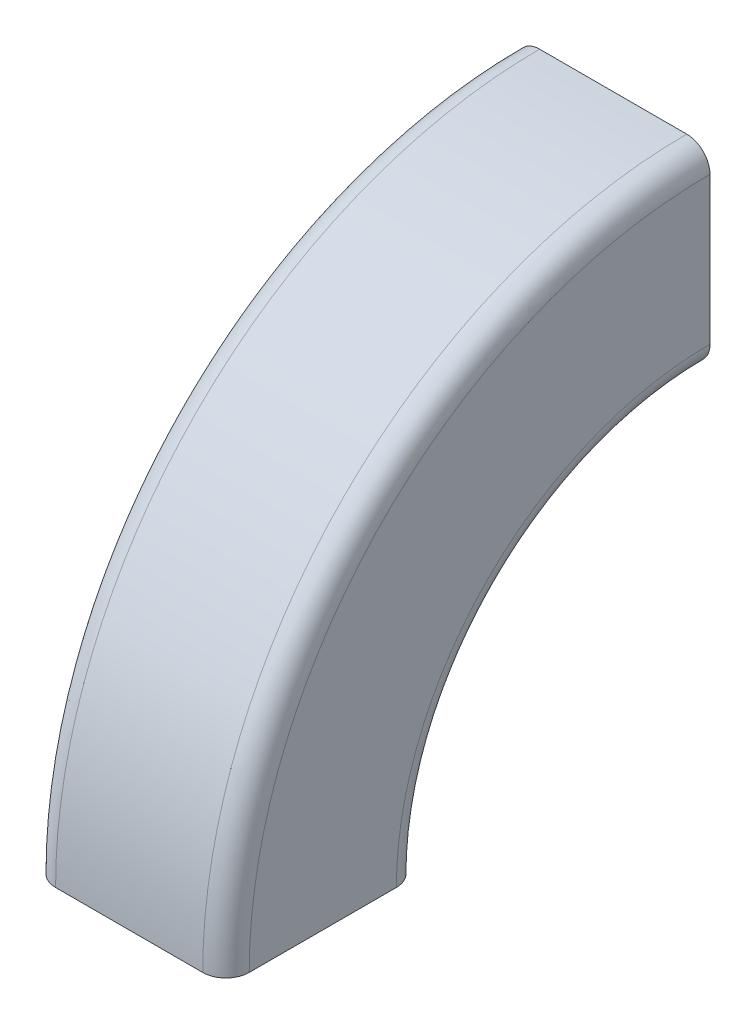
ISO-10303-21;
HEADER;
FILE_DESCRIPTION(('STEP AP214'),'2;1');
FILE_NAME('part.step','',(''),(''),'','','');
FILE_SCHEMA(('AUTOMOTIVE_DESIGN { 1 0 10303 214 1 1 1 1 }'));
ENDSEC;
DATA;
#1=APPLICATION_CONTEXT('core data for automotive mechanical design processes');
#2=APPLICATION_PROTOCOL_DEFINITION('international standard','automotive_design',2000,#1);
#3=PRODUCT_CONTEXT('',#1,'mechanical');
#4=PRODUCT('Part','Part','',(#3));
#5=PRODUCT_RELATED_PRODUCT_CATEGORY('part','',(#4));
#6=PRODUCT_DEFINITION_FORMATION('','',#4);
#7=PRODUCT_DEFINITION_CONTEXT('part definition',#1,'design');
#8=PRODUCT_DEFINITION('design','',#6,#7);
#9=PRODUCT_DEFINITION_SHAPE('','',#8);
#10=(LENGTH_UNIT() NAMED_UNIT(*) SI_UNIT(.MILLI.,.METRE.));
#11=(NAMED_UNIT(*) PLANE_ANGLE_UNIT() SI_UNIT($,.RADIAN.));
#12=(NAMED_UNIT(*) SI_UNIT($,.STERADIAN.) SOLID_ANGLE_UNIT());
#13=UNCERTAINTY_MEASURE_WITH_UNIT(LENGTH_MEASURE(1.E-05),#10,'distance_accuracy_value','');
#14=(GEOMETRIC_REPRESENTATION_CONTEXT(3) GLOBAL_UNCERTAINTY_ASSIGNED_CONTEXT((#13)) GLOBAL_UNIT_ASSIGNED_CONTEXT((#10,
#11,#12)) REPRESENTATION_CONTEXT('',''));
#15=CARTESIAN_POINT('',(0.,0.,0.));
#16=DIRECTION('',(0.,0.,1.));
#17=DIRECTION('',(1.,0.,0.));
#18=AXIS2_PLACEMENT_3D('',#15,#16,#17);
#19=CARTESIAN_POINT('',(0.,0.,0.));
#20=DIRECTION('',(0.,0.,1.));
#21=DIRECTION('',(1.,0.,0.));
#22=AXIS2_PLACEMENT_3D('',#19,#20,#21);
#23=PLANE('',#22);
#24=CARTESIAN_POINT('',(-9.5,-9.5,0.));
#25=DIRECTION('',(0.,0.,-1.));
#26=DIRECTION('',(1.,0.,0.));
#27=AXIS2_PLACEMENT_3D('',#24,#25,#26);
#28=CIRCLE('',#27,3.);
#29=CARTESIAN_POINT('',(-9.5,-12.5,0.));
#30=VERTEX_POINT('',#29);
#31=CARTESIAN_POINT('',(-12.5,-9.5,0.));
#32=VERTEX_POINT('',#31);
#33=EDGE_CURVE('E27',#30,#32,#28,.T.);
#34=ORIENTED_EDGE('',*,*,#33,.T.);
#35=DIRECTION('',(0.,1.,0.));
#36=VECTOR('',#35,1.);
#37=CARTESIAN_POINT('',(-12.5,-9.5,0.));
#38=LINE('',#37,#36);
#39=CARTESIAN_POINT('',(-12.5,9.5,0.));
#40=VERTEX_POINT('',#39);
#41=EDGE_CURVE('E268',#32,#40,#38,.T.);
#42=ORIENTED_EDGE('',*,*,#41,.T.);
#43=CARTESIAN_POINT('',(-9.5,9.5,0.));
#44=DIRECTION('',(0.,0.,-1.));
#45=DIRECTION('',(0.,-1.,0.));
#46=AXIS2_PLACEMENT_3D('',#43,#44,#45);
#47=CIRCLE('',#46,3.);
#48=CARTESIAN_POINT('',(-9.5,12.5,0.));
#49=VERTEX_POINT('',#48);
#50=EDGE_CURVE('E185',#40,#49,#47,.T.);
#51=ORIENTED_EDGE('',*,*,#50,.T.);
#52=DIRECTION('',(1.,0.,0.));
#53=VECTOR('',#52,1.);
#54=CARTESIAN_POINT('',(-9.5,12.5,0.));
#55=LINE('',#54,#53);
#56=CARTESIAN_POINT('',(9.5,12.5,0.));
#57=VERTEX_POINT('',#56);
#58=EDGE_CURVE('E170',#49,#57,#55,.T.);
#59=ORIENTED_EDGE('',*,*,#58,.T.);
#60=CARTESIAN_POINT('',(9.5,9.5,0.));
#61=DIRECTION('',(0.,0.,-1.));
#62=DIRECTION('',(-1.,0.,0.));
#63=AXIS2_PLACEMENT_3D('',#60,#61,#62);
#64=CIRCLE('',#63,3.);
#65=CARTESIAN_POINT('',(12.5,9.5,0.));
#66=VERTEX_POINT('',#65);
#67=EDGE_CURVE('E242',#57,#66,#64,.T.);
#68=ORIENTED_EDGE('',*,*,#67,.T.);
#69=DIRECTION('',(0.,-1.,0.));
#70=VECTOR('',#69,1.);
#71=CARTESIAN_POINT('',(12.5,9.5,0.));
#72=LINE('',#71,#70);
#73=CARTESIAN_POINT('',(12.5,-9.5,0.));
#74=VERTEX_POINT('',#73);
#75=EDGE_CURVE('E251',#66,#74,#72,.T.);
#76=ORIENTED_EDGE('',*,*,#75,.T.);
#77=CARTESIAN_POINT('',(9.5,-9.5,0.));
#78=DIRECTION('',(0.,0.,-1.));
#79=DIRECTION('',(0.,1.,0.));
#80=AXIS2_PLACEMENT_3D('',#77,#78,#79);
#81=CIRCLE('',#80,3.);
#82=CARTESIAN_POINT('',(9.5,-12.5,0.));
#83=VERTEX_POINT('',#82);
#84=EDGE_CURVE('E294',#74,#83,#81,.T.);
#85=ORIENTED_EDGE('',*,*,#84,.T.);
#86=DIRECTION('',(-1.,0.,0.));
#87=VECTOR('',#86,1.);
#88=CARTESIAN_POINT('',(9.5,-12.5,0.));
#89=LINE('',#88,#87);
#90=EDGE_CURVE('E282',#83,#30,#89,.T.);
#91=ORIENTED_EDGE('',*,*,#90,.T.);
#92=EDGE_LOOP('',(#34,#42,#51,#59,#68,#76,#85,#91));
#93=FACE_BOUND('',#92,.T.);
#94=DIRECTION('',(-1.,0.,0.));
#95=VECTOR('',#94,1.);
#96=CARTESIAN_POINT('',(0.,10.5,0.));
#97=LINE('',#96,#95);
#98=CARTESIAN_POINT('',(9.5,10.5,0.));
#99=VERTEX_POINT('',#98);
#100=CARTESIAN_POINT('',(-9.5,10.5,0.));
#101=VERTEX_POINT('',#100);
#102=EDGE_CURVE('E279',#99,#101,#97,.T.);
#103=ORIENTED_EDGE('',*,*,#102,.T.);
#104=CARTESIAN_POINT('',(-9.5,9.5,0.));
#105=DIRECTION('',(0.,0.,1.));
#106=DIRECTION('',(0.,1.,0.));
#107=AXIS2_PLACEMENT_3D('',#104,#105,#106);
#108=CIRCLE('',#107,1.);
#109=CARTESIAN_POINT('',(-10.5,9.5,0.));
#110=VERTEX_POINT('',#109);
#111=EDGE_CURVE('E194',#101,#110,#108,.T.);
#112=ORIENTED_EDGE('',*,*,#111,.T.);
#113=DIRECTION('',(0.,-1.,0.));
#114=VECTOR('',#113,1.);
#115=CARTESIAN_POINT('',(-10.5,4.75,0.));
#116=LINE('',#115,#114);
#117=CARTESIAN_POINT('',(-10.5,-9.5,0.));
#118=VERTEX_POINT('',#117);
#119=EDGE_CURVE('E202',#110,#118,#116,.T.);
#120=ORIENTED_EDGE('',*,*,#119,.T.);
#121=CARTESIAN_POINT('',(-9.5,-9.5,0.));
#122=DIRECTION('',(0.,0.,1.));
#123=DIRECTION('',(0.,1.,0.));
#124=AXIS2_PLACEMENT_3D('',#121,#122,#123);
#125=CIRCLE('',#124,1.);
#126=CARTESIAN_POINT('',(-9.5,-10.5,0.));
#127=VERTEX_POINT('',#126);
#128=EDGE_CURVE('E219',#118,#127,#125,.T.);
#129=ORIENTED_EDGE('',*,*,#128,.T.);
#130=DIRECTION('',(1.,0.,0.));
#131=VECTOR('',#130,1.);
#132=CARTESIAN_POINT('',(0.,-10.5,0.));
#133=LINE('',#132,#131);
#134=CARTESIAN_POINT('',(9.5,-10.5,0.));
#135=VERTEX_POINT('',#134);
#136=EDGE_CURVE('E201',#127,#135,#133,.T.);
#137=ORIENTED_EDGE('',*,*,#136,.T.);
#138=CARTESIAN_POINT('',(9.5,-9.5,0.));
#139=DIRECTION('',(0.,0.,1.));
#140=DIRECTION('',(0.,1.,0.));
#141=AXIS2_PLACEMENT_3D('',#138,#139,#140);
#142=CIRCLE('',#141,1.);
#143=CARTESIAN_POINT('',(10.5,-9.5,0.));
#144=VERTEX_POINT('',#143);
#145=EDGE_CURVE('E211',#135,#144,#142,.T.);
#146=ORIENTED_EDGE('',*,*,#145,.T.);
#147=DIRECTION('',(0.,1.,0.));
#148=VECTOR('',#147,1.);
#149=CARTESIAN_POINT('',(10.5,-4.75,0.));
#150=LINE('',#149,#148);
#151=CARTESIAN_POINT('',(10.5,9.5,0.));
#152=VERTEX_POINT('',#151);
#153=EDGE_CURVE('E229',#144,#152,#150,.T.);
#154=ORIENTED_EDGE('',*,*,#153,.T.);
#155=CARTESIAN_POINT('',(9.5,9.5,0.));
#156=DIRECTION('',(0.,0.,1.));
#157=DIRECTION('',(0.,1.,0.));
#158=AXIS2_PLACEMENT_3D('',#155,#156,#157);
#159=CIRCLE('',#158,1.);
#160=EDGE_CURVE('E220',#152,#99,#159,.T.);
#161=ORIENTED_EDGE('',*,*,#160,.T.);
#162=EDGE_LOOP('',(#103,#112,#120,#129,#137,#146,#154,#161));
#163=FACE_BOUND('',#162,.T.);
#164=ADVANCED_FACE('F16',(#93,#163),#23,.F.);
#165=CARTESIAN_POINT('',(0.,-50.,50.));
#166=DIRECTION('',(0.,-1.,0.));
#167=DIRECTION('',(-1.,0.,0.));
#168=AXIS2_PLACEMENT_3D('',#165,#166,#167);
#169=PLANE('',#168);
#170=CARTESIAN_POINT('',(-9.5,-50.,40.5));
#171=DIRECTION('',(0.,-1.,0.));
#172=DIRECTION('',(1.,0.,0.));
#173=AXIS2_PLACEMENT_3D('',#170,#171,#172);
#174=CIRCLE('',#173,3.);
#175=CARTESIAN_POINT('',(-12.5,-50.,40.5));
#176=VERTEX_POINT('',#175);
#177=CARTESIAN_POINT('',(-9.5,-50.,37.5));
#178=VERTEX_POINT('',#177);
#179=EDGE_CURVE('E11',#176,#178,#174,.T.);
#180=ORIENTED_EDGE('',*,*,#179,.T.);
#181=DIRECTION('',(1.,0.,0.));
#182=VECTOR('',#181,1.);
#183=CARTESIAN_POINT('',(9.5,-50.,37.5));
#184=LINE('',#183,#182);
#185=CARTESIAN_POINT('',(9.5,-50.,37.5));
#186=VERTEX_POINT('',#185);
#187=EDGE_CURVE('E237',#178,#186,#184,.T.);
#188=ORIENTED_EDGE('',*,*,#187,.T.);
#189=CARTESIAN_POINT('',(9.5,-50.,40.5));
#190=DIRECTION('',(0.,-1.,0.));
#191=DIRECTION('',(0.,0.,1.));
#192=AXIS2_PLACEMENT_3D('',#189,#190,#191);
#193=CIRCLE('',#192,3.);
#194=CARTESIAN_POINT('',(12.5,-50.,40.5));
#195=VERTEX_POINT('',#194);
#196=EDGE_CURVE('E291',#186,#195,#193,.T.);
#197=ORIENTED_EDGE('',*,*,#196,.T.);
#198=DIRECTION('',(0.,0.,1.));
#199=VECTOR('',#198,1.);
#200=CARTESIAN_POINT('',(12.5,-50.,59.5));
#201=LINE('',#200,#199);
#202=CARTESIAN_POINT('',(12.5,-50.,59.5));
#203=VERTEX_POINT('',#202);
#204=EDGE_CURVE('E248',#195,#203,#201,.T.);
#205=ORIENTED_EDGE('',*,*,#204,.T.);
#206=CARTESIAN_POINT('',(9.5,-50.,59.5));
#207=DIRECTION('',(0.,-1.,0.));
#208=DIRECTION('',(-1.,0.,0.));
#209=AXIS2_PLACEMENT_3D('',#206,#207,#208);
#210=CIRCLE('',#209,3.);
#211=CARTESIAN_POINT('',(9.5,-50.,62.5));
#212=VERTEX_POINT('',#211);
#213=EDGE_CURVE('E164',#203,#212,#210,.T.);
#214=ORIENTED_EDGE('',*,*,#213,.T.);
#215=DIRECTION('',(-1.,0.,0.));
#216=VECTOR('',#215,1.);
#217=CARTESIAN_POINT('',(-9.5,-50.,62.5));
#218=LINE('',#217,#216);
#219=CARTESIAN_POINT('',(-9.5,-50.,62.5));
#220=VERTEX_POINT('',#219);
#221=EDGE_CURVE('E155',#212,#220,#218,.T.);
#222=ORIENTED_EDGE('',*,*,#221,.T.);
#223=CARTESIAN_POINT('',(-9.5,-50.,59.5));
#224=DIRECTION('',(0.,-1.,0.));
#225=DIRECTION('',(0.,0.,-1.));
#226=AXIS2_PLACEMENT_3D('',#223,#224,#225);
#227=CIRCLE('',#226,3.);
#228=CARTESIAN_POINT('',(-12.5,-50.,59.5));
#229=VERTEX_POINT('',#228);
#230=EDGE_CURVE('E160',#220,#229,#227,.T.);
#231=ORIENTED_EDGE('',*,*,#230,.T.);
#232=DIRECTION('',(0.,0.,-1.));
#233=VECTOR('',#232,1.);
#234=CARTESIAN_POINT('',(-12.5,-50.,40.5));
#235=LINE('',#234,#233);
#236=EDGE_CURVE('E20',#229,#176,#235,.T.);
#237=ORIENTED_EDGE('',*,*,#236,.T.);
#238=EDGE_LOOP('',(#180,#188,#197,#205,#214,#222,#231,#237));
#239=FACE_BOUND('',#238,.T.);
#240=DIRECTION('',(1.,0.,0.));
#241=VECTOR('',#240,1.);
#242=CARTESIAN_POINT('',(0.,-50.,60.5));
#243=LINE('',#242,#241);
#244=CARTESIAN_POINT('',(-9.5,-50.,60.5));
#245=VERTEX_POINT('',#244);
#246=CARTESIAN_POINT('',(9.5,-50.,60.5));
#247=VERTEX_POINT('',#246);
#248=EDGE_CURVE('E278',#245,#247,#243,.T.);
#249=ORIENTED_EDGE('',*,*,#248,.T.);
#250=CARTESIAN_POINT('',(9.5,-50.,59.5));
#251=DIRECTION('',(0.,1.,0.));
#252=DIRECTION('',(0.,0.,1.));
#253=AXIS2_PLACEMENT_3D('',#250,#251,#252);
#254=CIRCLE('',#253,1.);
#255=CARTESIAN_POINT('',(10.5,-50.,59.5));
#256=VERTEX_POINT('',#255);
#257=EDGE_CURVE('E225',#247,#256,#254,.T.);
#258=ORIENTED_EDGE('',*,*,#257,.T.);
#259=DIRECTION('',(0.,0.,-1.));
#260=VECTOR('',#259,1.);
#261=CARTESIAN_POINT('',(10.5,-50.,25.));
#262=LINE('',#261,#260);
#263=CARTESIAN_POINT('',(10.5,-50.,40.5));
#264=VERTEX_POINT('',#263);
#265=EDGE_CURVE('E215',#256,#264,#262,.T.);
#266=ORIENTED_EDGE('',*,*,#265,.T.);
#267=CARTESIAN_POINT('',(9.5,-50.,40.5));
#268=DIRECTION('',(0.,1.,0.));
#269=DIRECTION('',(0.,0.,1.));
#270=AXIS2_PLACEMENT_3D('',#267,#268,#269);
#271=CIRCLE('',#270,1.);
#272=CARTESIAN_POINT('',(9.5,-50.,39.5));
#273=VERTEX_POINT('',#272);
#274=EDGE_CURVE('E247',#264,#273,#271,.T.);
#275=ORIENTED_EDGE('',*,*,#274,.T.);
#276=DIRECTION('',(-1.,0.,0.));
#277=VECTOR('',#276,1.);
#278=CARTESIAN_POINT('',(0.,-50.,39.5));
#279=LINE('',#278,#277);
#280=CARTESIAN_POINT('',(-9.5,-50.,39.5));
#281=VERTEX_POINT('',#280);
#282=EDGE_CURVE('E200',#273,#281,#279,.T.);
#283=ORIENTED_EDGE('',*,*,#282,.T.);
#284=CARTESIAN_POINT('',(-9.5,-50.,40.5));
#285=DIRECTION('',(0.,1.,0.));
#286=DIRECTION('',(0.,0.,1.));
#287=AXIS2_PLACEMENT_3D('',#284,#285,#286);
#288=CIRCLE('',#287,1.);
#289=CARTESIAN_POINT('',(-10.5,-50.,40.5));
#290=VERTEX_POINT('',#289);
#291=EDGE_CURVE('E205',#281,#290,#288,.T.);
#292=ORIENTED_EDGE('',*,*,#291,.T.);
#293=DIRECTION('',(0.,0.,1.));
#294=VECTOR('',#293,1.);
#295=CARTESIAN_POINT('',(-10.5,-50.,25.));
#296=LINE('',#295,#294);
#297=CARTESIAN_POINT('',(-10.5,-50.,59.5));
#298=VERTEX_POINT('',#297);
#299=EDGE_CURVE('E259',#290,#298,#296,.T.);
#300=ORIENTED_EDGE('',*,*,#299,.T.);
#301=CARTESIAN_POINT('',(-9.5,-50.,59.5));
#302=DIRECTION('',(0.,1.,0.));
#303=DIRECTION('',(0.,0.,1.));
#304=AXIS2_PLACEMENT_3D('',#301,#302,#303);
#305=CIRCLE('',#304,1.);
#306=EDGE_CURVE('E273',#298,#245,#305,.T.);
#307=ORIENTED_EDGE('',*,*,#306,.T.);
#308=EDGE_LOOP('',(#249,#258,#266,#275,#283,#292,#300,#307));
#309=FACE_BOUND('',#308,.T.);
#310=ADVANCED_FACE('F157',(#239,#309),#169,.T.);
#311=CARTESIAN_POINT('',(-9.5,-50.,0.));
#312=DIRECTION('',(1.,0.,0.));
#313=DIRECTION('',(0.,0.,-1.));
#314=AXIS2_PLACEMENT_3D('',#311,#312,#313);
#315=TOROIDAL_SURFACE('',#314,40.5,3.);
#316=ORIENTED_EDGE('',*,*,#33,.F.);
#317=CARTESIAN_POINT('',(-9.5,-50.,0.));
#318=DIRECTION('',(1.,0.,0.));
#319=DIRECTION('',(0.,1.,0.));
#320=AXIS2_PLACEMENT_3D('',#317,#318,#319);
#321=CIRCLE('',#320,37.5);
#322=EDGE_CURVE('E234',#30,#178,#321,.T.);
#323=ORIENTED_EDGE('',*,*,#322,.T.);
#324=ORIENTED_EDGE('',*,*,#179,.F.);
#325=CARTESIAN_POINT('',(-12.5,-50.,0.));
#326=DIRECTION('',(1.,0.,0.));
#327=DIRECTION('',(0.,1.,0.));
#328=AXIS2_PLACEMENT_3D('',#325,#326,#327);
#329=CIRCLE('',#328,40.5);
#330=EDGE_CURVE('E272',#32,#176,#329,.T.);
#331=ORIENTED_EDGE('',*,*,#330,.F.);
#332=EDGE_LOOP('',(#316,#323,#324,#331));
#333=FACE_BOUND('',#332,.T.);
#334=ADVANCED_FACE('F307',(#333),#315,.T.);
#335=CARTESIAN_POINT('',(0.,-50.,0.));
#336=DIRECTION('',(1.,0.,0.));
#337=DIRECTION('',(0.,1.,0.));
#338=AXIS2_PLACEMENT_3D('',#335,#336,#337);
#339=CYLINDRICAL_SURFACE('',#338,37.5);
#340=ORIENTED_EDGE('',*,*,#90,.F.);
#341=CARTESIAN_POINT('',(9.5,-50.,0.));
#342=DIRECTION('',(1.,0.,0.));
#343=DIRECTION('',(0.,1.,0.));
#344=AXIS2_PLACEMENT_3D('',#341,#342,#343);
#345=CIRCLE('',#344,37.5);
#346=EDGE_CURVE('E293',#83,#186,#345,.T.);
#347=ORIENTED_EDGE('',*,*,#346,.T.);
#348=ORIENTED_EDGE('',*,*,#187,.F.);
#349=ORIENTED_EDGE('',*,*,#322,.F.);
#350=EDGE_LOOP('',(#340,#347,#348,#349));
#351=FACE_BOUND('',#350,.T.);
#352=ADVANCED_FACE('F18',(#351),#339,.F.);
#353=CARTESIAN_POINT('',(9.5,-50.,0.));
#354=DIRECTION('',(1.,0.,0.));
#355=DIRECTION('',(0.,0.,-1.));
#356=AXIS2_PLACEMENT_3D('',#353,#354,#355);
#357=TOROIDAL_SURFACE('',#356,40.5,3.);
#358=ORIENTED_EDGE('',*,*,#84,.F.);
#359=CARTESIAN_POINT('',(12.5,-50.,0.));
#360=DIRECTION('',(1.,0.,0.));
#361=DIRECTION('',(0.,1.,0.));
#362=AXIS2_PLACEMENT_3D('',#359,#360,#361);
#363=CIRCLE('',#362,40.5);
#364=EDGE_CURVE('E250',#74,#195,#363,.T.);
#365=ORIENTED_EDGE('',*,*,#364,.T.);
#366=ORIENTED_EDGE('',*,*,#196,.F.);
#367=ORIENTED_EDGE('',*,*,#346,.F.);
#368=EDGE_LOOP('',(#358,#365,#366,#367));
#369=FACE_BOUND('',#368,.T.);
#370=ADVANCED_FACE('F536',(#369),#357,.T.);
#371=CARTESIAN_POINT('',(12.5,-9.5,0.));
#372=DIRECTION('',(1.,0.,0.));
#373=DIRECTION('',(0.,0.,-1.));
#374=AXIS2_PLACEMENT_3D('',#371,#372,#373);
#375=PLANE('',#374);
#376=ORIENTED_EDGE('',*,*,#75,.F.);
#377=CARTESIAN_POINT('',(12.5,-50.,0.));
#378=DIRECTION('',(1.,0.,0.));
#379=DIRECTION('',(0.,1.,0.));
#380=AXIS2_PLACEMENT_3D('',#377,#378,#379);
#381=CIRCLE('',#380,59.5);
#382=EDGE_CURVE('E241',#66,#203,#381,.T.);
#383=ORIENTED_EDGE('',*,*,#382,.T.);
#384=ORIENTED_EDGE('',*,*,#204,.F.);
#385=ORIENTED_EDGE('',*,*,#364,.F.);
#386=EDGE_LOOP('',(#376,#383,#384,#385));
#387=FACE_BOUND('',#386,.T.);
#388=ADVANCED_FACE('F530',(#387),#375,.T.);
#389=CARTESIAN_POINT('',(9.5,-50.,0.));
#390=DIRECTION('',(1.,0.,0.));
#391=DIRECTION('',(0.,0.,-1.));
#392=AXIS2_PLACEMENT_3D('',#389,#390,#391);
#393=TOROIDAL_SURFACE('',#392,59.5,3.);
#394=ORIENTED_EDGE('',*,*,#67,.F.);
#395=CARTESIAN_POINT('',(9.5,-50.,0.));
#396=DIRECTION('',(1.,0.,0.));
#397=DIRECTION('',(0.,1.,0.));
#398=AXIS2_PLACEMENT_3D('',#395,#396,#397);
#399=CIRCLE('',#398,62.5);
#400=EDGE_CURVE('E169',#57,#212,#399,.T.);
#401=ORIENTED_EDGE('',*,*,#400,.T.);
#402=ORIENTED_EDGE('',*,*,#213,.F.);
#403=ORIENTED_EDGE('',*,*,#382,.F.);
#404=EDGE_LOOP('',(#394,#401,#402,#403));
#405=FACE_BOUND('',#404,.T.);
#406=ADVANCED_FACE('F535',(#405),#393,.T.);
#407=CARTESIAN_POINT('',(0.,-50.,0.));
#408=DIRECTION('',(1.,0.,0.));
#409=DIRECTION('',(0.,1.,0.));
#410=AXIS2_PLACEMENT_3D('',#407,#408,#409);
#411=CYLINDRICAL_SURFACE('',#410,62.5);
#412=ORIENTED_EDGE('',*,*,#58,.F.);
#413=CARTESIAN_POINT('',(-9.5,-50.,0.));
#414=DIRECTION('',(1.,0.,0.));
#415=DIRECTION('',(0.,1.,0.));
#416=AXIS2_PLACEMENT_3D('',#413,#414,#415);
#417=CIRCLE('',#416,62.5);
#418=EDGE_CURVE('E173',#49,#220,#417,.T.);
#419=ORIENTED_EDGE('',*,*,#418,.T.);
#420=ORIENTED_EDGE('',*,*,#221,.F.);
#421=ORIENTED_EDGE('',*,*,#400,.F.);
#422=EDGE_LOOP('',(#412,#419,#420,#421));
#423=FACE_BOUND('',#422,.T.);
#424=ADVANCED_FACE('F174',(#423),#411,.T.);
#425=CARTESIAN_POINT('',(-9.5,-50.,0.));
#426=DIRECTION('',(1.,0.,0.));
#427=DIRECTION('',(0.,0.,-1.));
#428=AXIS2_PLACEMENT_3D('',#425,#426,#427);
#429=TOROIDAL_SURFACE('',#428,59.5,3.);
#430=ORIENTED_EDGE('',*,*,#50,.F.);
#431=CARTESIAN_POINT('',(-12.5,-50.,0.));
#432=DIRECTION('',(1.,0.,0.));
#433=DIRECTION('',(0.,1.,0.));
#434=AXIS2_PLACEMENT_3D('',#431,#432,#433);
#435=CIRCLE('',#434,59.5);
#436=EDGE_CURVE('E182',#40,#229,#435,.T.);
#437=ORIENTED_EDGE('',*,*,#436,.T.);
#438=ORIENTED_EDGE('',*,*,#230,.F.);
#439=ORIENTED_EDGE('',*,*,#418,.F.);
#440=EDGE_LOOP('',(#430,#437,#438,#439));
#441=FACE_BOUND('',#440,.T.);
#442=ADVANCED_FACE('F180',(#441),#429,.T.);
#443=CARTESIAN_POINT('',(-12.5,9.5,0.));
#444=DIRECTION('',(-1.,0.,0.));
#445=DIRECTION('',(0.,1.,0.));
#446=AXIS2_PLACEMENT_3D('',#443,#444,#445);
#447=PLANE('',#446);
#448=ORIENTED_EDGE('',*,*,#41,.F.);
#449=ORIENTED_EDGE('',*,*,#330,.T.);
#450=ORIENTED_EDGE('',*,*,#236,.F.);
#451=ORIENTED_EDGE('',*,*,#436,.F.);
#452=EDGE_LOOP('',(#448,#449,#450,#451));
#453=FACE_BOUND('',#452,.T.);
#454=ADVANCED_FACE('F311',(#453),#447,.T.);
#455=CARTESIAN_POINT('',(-9.5,-50.,0.));
#456=DIRECTION('',(1.,0.,0.));
#457=DIRECTION('',(0.,0.,-1.));
#458=AXIS2_PLACEMENT_3D('',#455,#456,#457);
#459=TOROIDAL_SURFACE('',#458,59.5,1.);
#460=ORIENTED_EDGE('',*,*,#111,.F.);
#461=CARTESIAN_POINT('',(-9.5,-50.,0.));
#462=DIRECTION('',(1.,0.,0.));
#463=DIRECTION('',(0.,1.,0.));
#464=AXIS2_PLACEMENT_3D('',#461,#462,#463);
#465=CIRCLE('',#464,60.5);
#466=EDGE_CURVE('E224',#101,#245,#465,.T.);
#467=ORIENTED_EDGE('',*,*,#466,.T.);
#468=ORIENTED_EDGE('',*,*,#306,.F.);
#469=CARTESIAN_POINT('',(-10.5,-50.,0.));
#470=DIRECTION('',(1.,0.,0.));
#471=DIRECTION('',(0.,1.,0.));
#472=AXIS2_PLACEMENT_3D('',#469,#470,#471);
#473=CIRCLE('',#472,59.5);
#474=EDGE_CURVE('E204',#110,#298,#473,.T.);
#475=ORIENTED_EDGE('',*,*,#474,.F.);
#476=EDGE_LOOP('',(#460,#467,#468,#475));
#477=FACE_BOUND('',#476,.T.);
#478=ADVANCED_FACE('F338',(#477),#459,.F.);
#479=CARTESIAN_POINT('',(-10.5,9.5,0.));
#480=DIRECTION('',(-1.,0.,0.));
#481=DIRECTION('',(0.,1.,0.));
#482=AXIS2_PLACEMENT_3D('',#479,#480,#481);
#483=PLANE('',#482);
#484=ORIENTED_EDGE('',*,*,#119,.F.);
#485=ORIENTED_EDGE('',*,*,#474,.T.);
#486=ORIENTED_EDGE('',*,*,#299,.F.);
#487=CARTESIAN_POINT('',(-10.5,-50.,0.));
#488=DIRECTION('',(1.,0.,0.));
#489=DIRECTION('',(0.,1.,0.));
#490=AXIS2_PLACEMENT_3D('',#487,#488,#489);
#491=CIRCLE('',#490,40.5);
#492=EDGE_CURVE('E210',#118,#290,#491,.T.);
#493=ORIENTED_EDGE('',*,*,#492,.F.);
#494=EDGE_LOOP('',(#484,#485,#486,#493));
#495=FACE_BOUND('',#494,.T.);
#496=ADVANCED_FACE('F340',(#495),#483,.F.);
#497=CARTESIAN_POINT('',(-9.5,-50.,0.));
#498=DIRECTION('',(1.,0.,0.));
#499=DIRECTION('',(0.,0.,-1.));
#500=AXIS2_PLACEMENT_3D('',#497,#498,#499);
#501=TOROIDAL_SURFACE('',#500,40.5,1.);
#502=ORIENTED_EDGE('',*,*,#128,.F.);
#503=ORIENTED_EDGE('',*,*,#492,.T.);
#504=ORIENTED_EDGE('',*,*,#291,.F.);
#505=CARTESIAN_POINT('',(-9.5,-50.,0.));
#506=DIRECTION('',(1.,0.,0.));
#507=DIRECTION('',(0.,1.,0.));
#508=AXIS2_PLACEMENT_3D('',#505,#506,#507);
#509=CIRCLE('',#508,39.5);
#510=EDGE_CURVE('E196',#127,#281,#509,.T.);
#511=ORIENTED_EDGE('',*,*,#510,.F.);
#512=EDGE_LOOP('',(#502,#503,#504,#511));
#513=FACE_BOUND('',#512,.T.);
#514=ADVANCED_FACE('F344',(#513),#501,.F.);
#515=CARTESIAN_POINT('',(0.,-50.,0.));
#516=DIRECTION('',(1.,0.,0.));
#517=DIRECTION('',(0.,1.,0.));
#518=AXIS2_PLACEMENT_3D('',#515,#516,#517);
#519=CYLINDRICAL_SURFACE('',#518,39.5);
#520=ORIENTED_EDGE('',*,*,#136,.F.);
#521=ORIENTED_EDGE('',*,*,#510,.T.);
#522=ORIENTED_EDGE('',*,*,#282,.F.);
#523=CARTESIAN_POINT('',(9.5,-50.,0.));
#524=DIRECTION('',(1.,0.,0.));
#525=DIRECTION('',(0.,1.,0.));
#526=AXIS2_PLACEMENT_3D('',#523,#524,#525);
#527=CIRCLE('',#526,39.5);
#528=EDGE_CURVE('E214',#135,#273,#527,.T.);
#529=ORIENTED_EDGE('',*,*,#528,.F.);
#530=EDGE_LOOP('',(#520,#521,#522,#529));
#531=FACE_BOUND('',#530,.T.);
#532=ADVANCED_FACE('F351',(#531),#519,.T.);
#533=CARTESIAN_POINT('',(9.5,-50.,0.));
#534=DIRECTION('',(1.,0.,0.));
#535=DIRECTION('',(0.,0.,-1.));
#536=AXIS2_PLACEMENT_3D('',#533,#534,#535);
#537=TOROIDAL_SURFACE('',#536,40.5,1.);
#538=ORIENTED_EDGE('',*,*,#145,.F.);
#539=ORIENTED_EDGE('',*,*,#528,.T.);
#540=ORIENTED_EDGE('',*,*,#274,.F.);
#541=CARTESIAN_POINT('',(10.5,-50.,0.));
#542=DIRECTION('',(1.,0.,0.));
#543=DIRECTION('',(0.,1.,0.));
#544=AXIS2_PLACEMENT_3D('',#541,#542,#543);
#545=CIRCLE('',#544,40.5);
#546=EDGE_CURVE('E230',#144,#264,#545,.T.);
#547=ORIENTED_EDGE('',*,*,#546,.F.);
#548=EDGE_LOOP('',(#538,#539,#540,#547));
#549=FACE_BOUND('',#548,.T.);
#550=ADVANCED_FACE('F354',(#549),#537,.F.);
#551=CARTESIAN_POINT('',(10.5,-9.5,0.));
#552=DIRECTION('',(1.,0.,0.));
#553=DIRECTION('',(0.,0.,-1.));
#554=AXIS2_PLACEMENT_3D('',#551,#552,#553);
#555=PLANE('',#554);
#556=ORIENTED_EDGE('',*,*,#153,.F.);
#557=ORIENTED_EDGE('',*,*,#546,.T.);
#558=ORIENTED_EDGE('',*,*,#265,.F.);
#559=CARTESIAN_POINT('',(10.5,-50.,0.));
#560=DIRECTION('',(1.,0.,0.));
#561=DIRECTION('',(0.,1.,0.));
#562=AXIS2_PLACEMENT_3D('',#559,#560,#561);
#563=CIRCLE('',#562,59.5);
#564=EDGE_CURVE('E223',#152,#256,#563,.T.);
#565=ORIENTED_EDGE('',*,*,#564,.F.);
#566=EDGE_LOOP('',(#556,#557,#558,#565));
#567=FACE_BOUND('',#566,.T.);
#568=ADVANCED_FACE('F358',(#567),#555,.F.);
#569=CARTESIAN_POINT('',(9.5,-50.,0.));
#570=DIRECTION('',(1.,0.,0.));
#571=DIRECTION('',(0.,0.,-1.));
#572=AXIS2_PLACEMENT_3D('',#569,#570,#571);
#573=TOROIDAL_SURFACE('',#572,59.5,1.);
#574=ORIENTED_EDGE('',*,*,#160,.F.);
#575=ORIENTED_EDGE('',*,*,#564,.T.);
#576=ORIENTED_EDGE('',*,*,#257,.F.);
#577=CARTESIAN_POINT('',(9.5,-50.,0.));
#578=DIRECTION('',(1.,0.,0.));
#579=DIRECTION('',(0.,1.,0.));
#580=AXIS2_PLACEMENT_3D('',#577,#578,#579);
#581=CIRCLE('',#580,60.5);
#582=EDGE_CURVE('E274',#99,#247,#581,.T.);
#583=ORIENTED_EDGE('',*,*,#582,.F.);
#584=EDGE_LOOP('',(#574,#575,#576,#583));
#585=FACE_BOUND('',#584,.T.);
#586=ADVANCED_FACE('F362',(#585),#573,.F.);
#587=CARTESIAN_POINT('',(0.,-50.,0.));
#588=DIRECTION('',(1.,0.,0.));
#589=DIRECTION('',(0.,1.,0.));
#590=AXIS2_PLACEMENT_3D('',#587,#588,#589);
#591=CYLINDRICAL_SURFACE('',#590,60.5);
#592=ORIENTED_EDGE('',*,*,#102,.F.);
#593=ORIENTED_EDGE('',*,*,#582,.T.);
#594=ORIENTED_EDGE('',*,*,#248,.F.);
#595=ORIENTED_EDGE('',*,*,#466,.F.);
#596=EDGE_LOOP('',(#592,#593,#594,#595));
#597=FACE_BOUND('',#596,.T.);
#598=ADVANCED_FACE('F365',(#597),#591,.F.);
#599=CLOSED_SHELL('',(#164,#310,#334,#352,#370,#388,#406,#424,#442,#454,#478,#496,#514,#532,
#550,#568,#586,#598));
#600=MANIFOLD_SOLID_BREP('B1',#599);
#601=ADVANCED_BREP_SHAPE_REPRESENTATION('',(#18,#600),#14);
#602=SHAPE_DEFINITION_REPRESENTATION(#9,#601);
ENDSEC;
END-ISO-10303-21;
